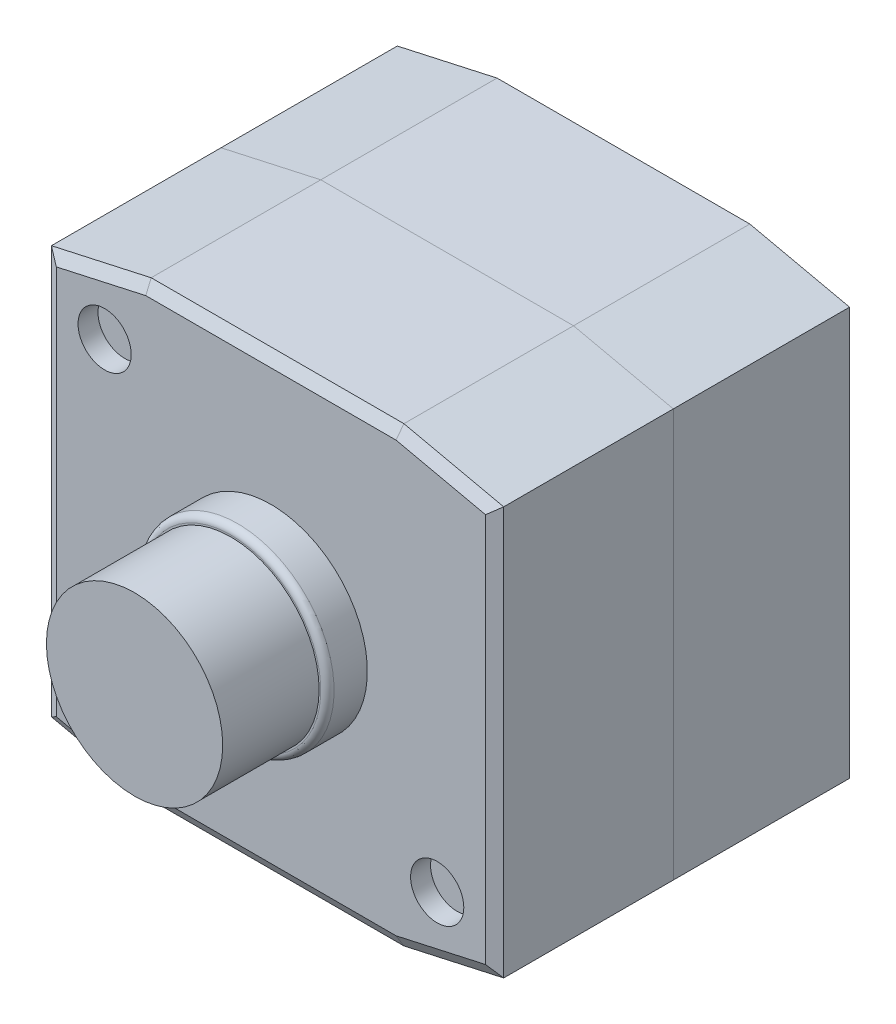
ISO-10303-21;
HEADER;
FILE_DESCRIPTION(('STEP AP214'),'2;1');
FILE_NAME('part.step','',(''),(''),'','','');
FILE_SCHEMA(('AUTOMOTIVE_DESIGN { 1 0 10303 214 1 1 1 1 }'));
ENDSEC;
DATA;
#1=APPLICATION_CONTEXT('core data for automotive mechanical design processes');
#2=APPLICATION_PROTOCOL_DEFINITION('international standard','automotive_design',2000,#1);
#3=PRODUCT_CONTEXT('',#1,'mechanical');
#4=PRODUCT('Part','Part','',(#3));
#5=PRODUCT_RELATED_PRODUCT_CATEGORY('part','',(#4));
#6=PRODUCT_DEFINITION_FORMATION('','',#4);
#7=PRODUCT_DEFINITION_CONTEXT('part definition',#1,'design');
#8=PRODUCT_DEFINITION('design','',#6,#7);
#9=PRODUCT_DEFINITION_SHAPE('','',#8);
#10=(LENGTH_UNIT() NAMED_UNIT(*) SI_UNIT(.MILLI.,.METRE.));
#11=(NAMED_UNIT(*) PLANE_ANGLE_UNIT() SI_UNIT($,.RADIAN.));
#12=(NAMED_UNIT(*) SI_UNIT($,.STERADIAN.) SOLID_ANGLE_UNIT());
#13=UNCERTAINTY_MEASURE_WITH_UNIT(LENGTH_MEASURE(1.E-05),#10,'distance_accuracy_value','');
#14=(GEOMETRIC_REPRESENTATION_CONTEXT(3) GLOBAL_UNCERTAINTY_ASSIGNED_CONTEXT((#13)) GLOBAL_UNIT_ASSIGNED_CONTEXT((#10,
#11,#12)) REPRESENTATION_CONTEXT('',''));
#15=CARTESIAN_POINT('',(0.,0.,0.));
#16=DIRECTION('',(0.,0.,1.));
#17=DIRECTION('',(1.,0.,0.));
#18=AXIS2_PLACEMENT_3D('',#15,#16,#17);
#19=CARTESIAN_POINT('',(-19.,0.,0.));
#20=DIRECTION('',(0.216439613938101,0.976296007119934,0.));
#21=DIRECTION('',(-0.976296007119934,0.216439613938101,0.));
#22=AXIS2_PLACEMENT_3D('',#19,#20,#21);
#23=PLANE('',#22);
#24=DIRECTION('',(-0.976296007119934,0.216439613938101,0.));
#25=VECTOR('',#24,1.);
#26=CARTESIAN_POINT('',(-19.,0.,26.5));
#27=LINE('',#26,#25);
#28=CARTESIAN_POINT('',(-19.,0.,26.5));
#29=VERTEX_POINT('',#28);
#30=CARTESIAN_POINT('',(-34.,3.32541993964407,26.5));
#31=VERTEX_POINT('',#30);
#32=EDGE_CURVE('E142',#29,#31,#27,.T.);
#33=ORIENTED_EDGE('',*,*,#32,.T.);
#34=DIRECTION('',(0.,0.,1.));
#35=VECTOR('',#34,1.);
#36=CARTESIAN_POINT('',(-34.,3.32541993964407,0.));
#37=LINE('',#36,#35);
#38=CARTESIAN_POINT('',(-34.,3.32541993964407,0.));
#39=VERTEX_POINT('',#38);
#40=EDGE_CURVE('E12',#39,#31,#37,.T.);
#41=ORIENTED_EDGE('',*,*,#40,.F.);
#42=DIRECTION('',(-0.976296007119934,0.216439613938101,0.));
#43=VECTOR('',#42,1.);
#44=CARTESIAN_POINT('',(-19.,0.,0.));
#45=LINE('',#44,#43);
#46=CARTESIAN_POINT('',(-19.,0.,0.));
#47=VERTEX_POINT('',#46);
#48=EDGE_CURVE('E156',#47,#39,#45,.T.);
#49=ORIENTED_EDGE('',*,*,#48,.F.);
#50=DIRECTION('',(0.,0.,1.));
#51=VECTOR('',#50,1.);
#52=CARTESIAN_POINT('',(-19.,0.,0.));
#53=LINE('',#52,#51);
#54=EDGE_CURVE('E138',#47,#29,#53,.T.);
#55=ORIENTED_EDGE('',*,*,#54,.T.);
#56=EDGE_LOOP('',(#33,#41,#49,#55));
#57=FACE_BOUND('',#56,.T.);
#58=ADVANCED_FACE('F46',(#57),#23,.F.);
#59=CARTESIAN_POINT('',(-34.,3.32541993964407,0.));
#60=DIRECTION('',(1.,0.,0.));
#61=DIRECTION('',(0.,1.,0.));
#62=AXIS2_PLACEMENT_3D('',#59,#60,#61);
#63=PLANE('',#62);
#64=DIRECTION('',(0.,1.,0.));
#65=VECTOR('',#64,1.);
#66=CARTESIAN_POINT('',(-34.,3.32541993964407,26.5));
#67=LINE('',#66,#65);
#68=CARTESIAN_POINT('',(-34.,64.674580060356,26.5));
#69=VERTEX_POINT('',#68);
#70=EDGE_CURVE('E145',#31,#69,#67,.T.);
#71=ORIENTED_EDGE('',*,*,#70,.T.);
#72=DIRECTION('',(0.,0.,1.));
#73=VECTOR('',#72,1.);
#74=CARTESIAN_POINT('',(-34.,64.674580060356,0.));
#75=LINE('',#74,#73);
#76=CARTESIAN_POINT('',(-34.,64.674580060356,0.));
#77=VERTEX_POINT('',#76);
#78=EDGE_CURVE('E54',#77,#69,#75,.T.);
#79=ORIENTED_EDGE('',*,*,#78,.F.);
#80=DIRECTION('',(0.,1.,0.));
#81=VECTOR('',#80,1.);
#82=CARTESIAN_POINT('',(-34.,3.32541993964407,0.));
#83=LINE('',#82,#81);
#84=EDGE_CURVE('E105',#39,#77,#83,.T.);
#85=ORIENTED_EDGE('',*,*,#84,.F.);
#86=ORIENTED_EDGE('',*,*,#40,.T.);
#87=EDGE_LOOP('',(#71,#79,#85,#86));
#88=FACE_BOUND('',#87,.T.);
#89=ADVANCED_FACE('F191',(#88),#63,.F.);
#90=CARTESIAN_POINT('',(-34.,64.674580060356,0.));
#91=DIRECTION('',(0.2164396139381,-0.976296007119934,0.));
#92=DIRECTION('',(0.976296007119934,0.2164396139381,0.));
#93=AXIS2_PLACEMENT_3D('',#90,#91,#92);
#94=PLANE('',#93);
#95=DIRECTION('',(0.976296007119934,0.2164396139381,0.));
#96=VECTOR('',#95,1.);
#97=CARTESIAN_POINT('',(-34.,64.674580060356,26.5));
#98=LINE('',#97,#96);
#99=CARTESIAN_POINT('',(-19.,68.,26.5));
#100=VERTEX_POINT('',#99);
#101=EDGE_CURVE('E147',#69,#100,#98,.T.);
#102=ORIENTED_EDGE('',*,*,#101,.T.);
#103=DIRECTION('',(0.,0.,1.));
#104=VECTOR('',#103,1.);
#105=CARTESIAN_POINT('',(-19.,68.,0.));
#106=LINE('',#105,#104);
#107=CARTESIAN_POINT('',(-19.,68.,0.));
#108=VERTEX_POINT('',#107);
#109=EDGE_CURVE('E163',#108,#100,#106,.T.);
#110=ORIENTED_EDGE('',*,*,#109,.F.);
#111=DIRECTION('',(0.976296007119934,0.2164396139381,0.));
#112=VECTOR('',#111,1.);
#113=CARTESIAN_POINT('',(-34.,64.674580060356,0.));
#114=LINE('',#113,#112);
#115=EDGE_CURVE('E171',#77,#108,#114,.T.);
#116=ORIENTED_EDGE('',*,*,#115,.F.);
#117=ORIENTED_EDGE('',*,*,#78,.T.);
#118=EDGE_LOOP('',(#102,#110,#116,#117));
#119=FACE_BOUND('',#118,.T.);
#120=ADVANCED_FACE('F169',(#119),#94,.F.);
#121=CARTESIAN_POINT('',(-19.,68.,0.));
#122=DIRECTION('',(0.,-1.,0.));
#123=DIRECTION('',(0.,0.,-1.));
#124=AXIS2_PLACEMENT_3D('',#121,#122,#123);
#125=PLANE('',#124);
#126=DIRECTION('',(1.,0.,0.));
#127=VECTOR('',#126,1.);
#128=CARTESIAN_POINT('',(-19.,68.,26.5));
#129=LINE('',#128,#127);
#130=CARTESIAN_POINT('',(19.,68.,26.5));
#131=VERTEX_POINT('',#130);
#132=EDGE_CURVE('E149',#100,#131,#129,.T.);
#133=ORIENTED_EDGE('',*,*,#132,.T.);
#134=DIRECTION('',(0.,0.,1.));
#135=VECTOR('',#134,1.);
#136=CARTESIAN_POINT('',(19.,68.,0.));
#137=LINE('',#136,#135);
#138=CARTESIAN_POINT('',(19.,68.,0.));
#139=VERTEX_POINT('',#138);
#140=EDGE_CURVE('E160',#139,#131,#137,.T.);
#141=ORIENTED_EDGE('',*,*,#140,.F.);
#142=DIRECTION('',(1.,0.,0.));
#143=VECTOR('',#142,1.);
#144=CARTESIAN_POINT('',(-19.,68.,0.));
#145=LINE('',#144,#143);
#146=EDGE_CURVE('E183',#108,#139,#145,.T.);
#147=ORIENTED_EDGE('',*,*,#146,.F.);
#148=ORIENTED_EDGE('',*,*,#109,.T.);
#149=EDGE_LOOP('',(#133,#141,#147,#148));
#150=FACE_BOUND('',#149,.T.);
#151=ADVANCED_FACE('F179',(#150),#125,.F.);
#152=CARTESIAN_POINT('',(19.,68.,0.));
#153=DIRECTION('',(-0.216439613938102,-0.976296007119934,0.));
#154=DIRECTION('',(0.976296007119934,-0.216439613938102,0.));
#155=AXIS2_PLACEMENT_3D('',#152,#153,#154);
#156=PLANE('',#155);
#157=DIRECTION('',(0.976296007119934,-0.216439613938102,0.));
#158=VECTOR('',#157,1.);
#159=CARTESIAN_POINT('',(19.,68.,26.5));
#160=LINE('',#159,#158);
#161=CARTESIAN_POINT('',(34.,64.6745800603559,26.5));
#162=VERTEX_POINT('',#161);
#163=EDGE_CURVE('E151',#131,#162,#160,.T.);
#164=ORIENTED_EDGE('',*,*,#163,.T.);
#165=DIRECTION('',(0.,0.,1.));
#166=VECTOR('',#165,1.);
#167=CARTESIAN_POINT('',(34.,64.6745800603559,0.));
#168=LINE('',#167,#166);
#169=CARTESIAN_POINT('',(34.,64.6745800603559,0.));
#170=VERTEX_POINT('',#169);
#171=EDGE_CURVE('E133',#170,#162,#168,.T.);
#172=ORIENTED_EDGE('',*,*,#171,.F.);
#173=DIRECTION('',(0.976296007119934,-0.216439613938102,0.));
#174=VECTOR('',#173,1.);
#175=CARTESIAN_POINT('',(19.,68.,0.));
#176=LINE('',#175,#174);
#177=EDGE_CURVE('E124',#139,#170,#176,.T.);
#178=ORIENTED_EDGE('',*,*,#177,.F.);
#179=ORIENTED_EDGE('',*,*,#140,.T.);
#180=EDGE_LOOP('',(#164,#172,#178,#179));
#181=FACE_BOUND('',#180,.T.);
#182=ADVANCED_FACE('F182',(#181),#156,.F.);
#183=CARTESIAN_POINT('',(34.,64.6745800603559,0.));
#184=DIRECTION('',(-1.,0.,0.));
#185=DIRECTION('',(0.,-1.,0.));
#186=AXIS2_PLACEMENT_3D('',#183,#184,#185);
#187=PLANE('',#186);
#188=DIRECTION('',(0.,-1.,0.));
#189=VECTOR('',#188,1.);
#190=CARTESIAN_POINT('',(34.,64.6745800603559,26.5));
#191=LINE('',#190,#189);
#192=CARTESIAN_POINT('',(34.,3.32541993964407,26.5));
#193=VERTEX_POINT('',#192);
#194=EDGE_CURVE('E132',#162,#193,#191,.T.);
#195=ORIENTED_EDGE('',*,*,#194,.T.);
#196=DIRECTION('',(0.,0.,1.));
#197=VECTOR('',#196,1.);
#198=CARTESIAN_POINT('',(34.,3.32541993964407,0.));
#199=LINE('',#198,#197);
#200=CARTESIAN_POINT('',(34.,3.32541993964407,0.));
#201=VERTEX_POINT('',#200);
#202=EDGE_CURVE('E129',#201,#193,#199,.T.);
#203=ORIENTED_EDGE('',*,*,#202,.F.);
#204=DIRECTION('',(0.,-1.,0.));
#205=VECTOR('',#204,1.);
#206=CARTESIAN_POINT('',(34.,64.6745800603559,0.));
#207=LINE('',#206,#205);
#208=EDGE_CURVE('E118',#170,#201,#207,.T.);
#209=ORIENTED_EDGE('',*,*,#208,.F.);
#210=ORIENTED_EDGE('',*,*,#171,.T.);
#211=EDGE_LOOP('',(#195,#203,#209,#210));
#212=FACE_BOUND('',#211,.T.);
#213=ADVANCED_FACE('F130',(#212),#187,.F.);
#214=CARTESIAN_POINT('',(34.,3.32541993964407,0.));
#215=DIRECTION('',(-0.216439613938101,0.976296007119934,0.));
#216=DIRECTION('',(-0.976296007119934,-0.216439613938101,0.));
#217=AXIS2_PLACEMENT_3D('',#214,#215,#216);
#218=PLANE('',#217);
#219=DIRECTION('',(-0.976296007119934,-0.216439613938101,0.));
#220=VECTOR('',#219,1.);
#221=CARTESIAN_POINT('',(34.,3.32541993964407,26.5));
#222=LINE('',#221,#220);
#223=CARTESIAN_POINT('',(19.,0.,26.5));
#224=VERTEX_POINT('',#223);
#225=EDGE_CURVE('E91',#193,#224,#222,.T.);
#226=ORIENTED_EDGE('',*,*,#225,.T.);
#227=DIRECTION('',(0.,0.,1.));
#228=VECTOR('',#227,1.);
#229=CARTESIAN_POINT('',(19.,0.,0.));
#230=LINE('',#229,#228);
#231=CARTESIAN_POINT('',(19.,0.,0.));
#232=VERTEX_POINT('',#231);
#233=EDGE_CURVE('E134',#232,#224,#230,.T.);
#234=ORIENTED_EDGE('',*,*,#233,.F.);
#235=DIRECTION('',(-0.976296007119934,-0.216439613938101,0.));
#236=VECTOR('',#235,1.);
#237=CARTESIAN_POINT('',(34.,3.32541993964407,0.));
#238=LINE('',#237,#236);
#239=EDGE_CURVE('E122',#201,#232,#238,.T.);
#240=ORIENTED_EDGE('',*,*,#239,.F.);
#241=ORIENTED_EDGE('',*,*,#202,.T.);
#242=EDGE_LOOP('',(#226,#234,#240,#241));
#243=FACE_BOUND('',#242,.T.);
#244=ADVANCED_FACE('F136',(#243),#218,.F.);
#245=CARTESIAN_POINT('',(19.,0.,0.));
#246=DIRECTION('',(0.,1.,0.));
#247=DIRECTION('',(0.,0.,1.));
#248=AXIS2_PLACEMENT_3D('',#245,#246,#247);
#249=PLANE('',#248);
#250=DIRECTION('',(-1.,0.,0.));
#251=VECTOR('',#250,1.);
#252=CARTESIAN_POINT('',(19.,0.,26.5));
#253=LINE('',#252,#251);
#254=EDGE_CURVE('E97',#224,#29,#253,.T.);
#255=ORIENTED_EDGE('',*,*,#254,.T.);
#256=ORIENTED_EDGE('',*,*,#54,.F.);
#257=DIRECTION('',(-1.,0.,0.));
#258=VECTOR('',#257,1.);
#259=CARTESIAN_POINT('',(19.,0.,0.));
#260=LINE('',#259,#258);
#261=EDGE_CURVE('E62',#232,#47,#260,.T.);
#262=ORIENTED_EDGE('',*,*,#261,.F.);
#263=ORIENTED_EDGE('',*,*,#233,.T.);
#264=EDGE_LOOP('',(#255,#256,#262,#263));
#265=FACE_BOUND('',#264,.T.);
#266=ADVANCED_FACE('F207',(#265),#249,.F.);
#267=CARTESIAN_POINT('',(0.,0.,0.));
#268=DIRECTION('',(0.,0.,-1.));
#269=DIRECTION('',(-1.,0.,0.));
#270=AXIS2_PLACEMENT_3D('',#267,#268,#269);
#271=PLANE('',#270);
#272=ORIENTED_EDGE('',*,*,#48,.T.);
#273=ORIENTED_EDGE('',*,*,#84,.T.);
#274=ORIENTED_EDGE('',*,*,#115,.T.);
#275=ORIENTED_EDGE('',*,*,#146,.T.);
#276=ORIENTED_EDGE('',*,*,#177,.T.);
#277=ORIENTED_EDGE('',*,*,#208,.T.);
#278=ORIENTED_EDGE('',*,*,#239,.T.);
#279=ORIENTED_EDGE('',*,*,#261,.T.);
#280=EDGE_LOOP('',(#272,#273,#274,#275,#276,#277,#278,#279));
#281=FACE_BOUND('',#280,.T.);
#282=ADVANCED_FACE('F120',(#281),#271,.T.);
#283=CARTESIAN_POINT('',(0.,0.,26.5));
#284=DIRECTION('',(0.,0.,-1.));
#285=DIRECTION('',(-1.,0.,0.));
#286=AXIS2_PLACEMENT_3D('',#283,#284,#285);
#287=PLANE('',#286);
#288=ORIENTED_EDGE('',*,*,#32,.F.);
#289=ORIENTED_EDGE('',*,*,#254,.F.);
#290=ORIENTED_EDGE('',*,*,#225,.F.);
#291=ORIENTED_EDGE('',*,*,#194,.F.);
#292=ORIENTED_EDGE('',*,*,#163,.F.);
#293=ORIENTED_EDGE('',*,*,#132,.F.);
#294=ORIENTED_EDGE('',*,*,#101,.F.);
#295=ORIENTED_EDGE('',*,*,#70,.F.);
#296=EDGE_LOOP('',(#288,#289,#290,#291,#292,#293,#294,#295));
#297=FACE_BOUND('',#296,.T.);
#298=ADVANCED_FACE('F175',(#297),#287,.F.);
#299=CLOSED_SHELL('',(#58,#89,#120,#151,#182,#213,#244,#266,#282,#298));
#300=MANIFOLD_SOLID_BREP('B2',#299);
#301=CARTESIAN_POINT('',(0.,34.,53.));
#302=DIRECTION('',(0.,0.,1.));
#303=DIRECTION('',(1.,0.,0.));
#304=AXIS2_PLACEMENT_3D('',#301,#302,#303);
#305=CYLINDRICAL_SURFACE('',#304,14.5);
#306=CARTESIAN_POINT('',(0.,34.,58.));
#307=DIRECTION('',(0.,0.,-1.));
#308=DIRECTION('',(-1.,0.,0.));
#309=AXIS2_PLACEMENT_3D('',#306,#307,#308);
#310=CIRCLE('',#309,14.5);
#311=CARTESIAN_POINT('',(-14.5,34.,58.));
#312=VERTEX_POINT('',#311);
#313=EDGE_CURVE('E281',#312,#312,#310,.T.);
#314=ORIENTED_EDGE('',*,*,#313,.T.);
#315=EDGE_LOOP('',(#314));
#316=FACE_BOUND('',#315,.T.);
#317=CARTESIAN_POINT('',(0.,34.,53.));
#318=DIRECTION('',(0.,0.,1.));
#319=DIRECTION('',(-1.,0.,0.));
#320=AXIS2_PLACEMENT_3D('',#317,#318,#319);
#321=CIRCLE('',#320,14.5);
#322=CARTESIAN_POINT('',(-14.5,34.,53.));
#323=VERTEX_POINT('',#322);
#324=EDGE_CURVE('E414',#323,#323,#321,.T.);
#325=ORIENTED_EDGE('',*,*,#324,.T.);
#326=EDGE_LOOP('',(#325));
#327=FACE_BOUND('',#326,.T.);
#328=ADVANCED_FACE('F273',(#316,#327),#305,.T.);
#329=CARTESIAN_POINT('',(0.,34.,59.));
#330=DIRECTION('',(0.,0.,-1.));
#331=DIRECTION('',(-1.,0.,0.));
#332=AXIS2_PLACEMENT_3D('',#329,#330,#331);
#333=PLANE('',#332);
#334=CARTESIAN_POINT('',(0.,34.,59.));
#335=DIRECTION('',(0.,0.,-1.));
#336=DIRECTION('',(-1.,0.,0.));
#337=AXIS2_PLACEMENT_3D('',#334,#335,#336);
#338=CIRCLE('',#337,13.25);
#339=CARTESIAN_POINT('',(-13.25,34.,59.));
#340=VERTEX_POINT('',#339);
#341=EDGE_CURVE('E44',#340,#340,#338,.F.);
#342=ORIENTED_EDGE('',*,*,#341,.F.);
#343=EDGE_LOOP('',(#342));
#344=FACE_BOUND('',#343,.T.);
#345=CARTESIAN_POINT('',(0.,34.,59.));
#346=DIRECTION('',(0.,0.,-1.));
#347=DIRECTION('',(-1.,0.,0.));
#348=AXIS2_PLACEMENT_3D('',#345,#346,#347);
#349=CIRCLE('',#348,13.5);
#350=CARTESIAN_POINT('',(-13.5,34.,59.));
#351=VERTEX_POINT('',#350);
#352=EDGE_CURVE('E487',#351,#351,#349,.F.);
#353=ORIENTED_EDGE('',*,*,#352,.T.);
#354=EDGE_LOOP('',(#353));
#355=FACE_BOUND('',#354,.T.);
#356=ADVANCED_FACE('F500',(#344,#355),#333,.F.);
#357=CARTESIAN_POINT('',(-34.,3.32541993964407,26.5));
#358=DIRECTION('',(-0.216439613938101,-0.976296007119934,0.));
#359=DIRECTION('',(0.976296007119934,-0.216439613938101,0.));
#360=AXIS2_PLACEMENT_3D('',#357,#358,#359);
#361=PLANE('',#360);
#362=DIRECTION('',(0.,0.,1.));
#363=VECTOR('',#362,1.);
#364=CARTESIAN_POINT('',(-19.,0.,26.5));
#365=LINE('',#364,#363);
#366=CARTESIAN_POINT('',(-19.,0.,26.5));
#367=VERTEX_POINT('',#366);
#368=CARTESIAN_POINT('',(-19.,0.,52.));
#369=VERTEX_POINT('',#368);
#370=EDGE_CURVE('E365',#367,#369,#365,.T.);
#371=ORIENTED_EDGE('',*,*,#370,.T.);
#372=DIRECTION('',(-0.976296007119934,0.216439613938101,0.));
#373=VECTOR('',#372,1.);
#374=CARTESIAN_POINT('',(-34.,3.32541993964407,52.));
#375=LINE('',#374,#373);
#376=CARTESIAN_POINT('',(-34.,3.32541993964407,52.));
#377=VERTEX_POINT('',#376);
#378=EDGE_CURVE('E456',#369,#377,#375,.T.);
#379=ORIENTED_EDGE('',*,*,#378,.T.);
#380=DIRECTION('',(0.,0.,1.));
#381=VECTOR('',#380,1.);
#382=CARTESIAN_POINT('',(-34.,3.32541993964407,26.5));
#383=LINE('',#382,#381);
#384=CARTESIAN_POINT('',(-34.,3.32541993964407,26.5));
#385=VERTEX_POINT('',#384);
#386=EDGE_CURVE('E391',#385,#377,#383,.T.);
#387=ORIENTED_EDGE('',*,*,#386,.F.);
#388=DIRECTION('',(0.976296007119934,-0.216439613938101,0.));
#389=VECTOR('',#388,1.);
#390=CARTESIAN_POINT('',(-34.,3.32541993964407,26.5));
#391=LINE('',#390,#389);
#392=EDGE_CURVE('E383',#385,#367,#391,.T.);
#393=ORIENTED_EDGE('',*,*,#392,.T.);
#394=EDGE_LOOP('',(#371,#379,#387,#393));
#395=FACE_BOUND('',#394,.T.);
#396=ADVANCED_FACE('F389',(#395),#361,.T.);
#397=CARTESIAN_POINT('',(-34.,64.674580060356,26.5));
#398=DIRECTION('',(-1.,0.,0.));
#399=DIRECTION('',(0.,-1.,0.));
#400=AXIS2_PLACEMENT_3D('',#397,#398,#399);
#401=PLANE('',#400);
#402=ORIENTED_EDGE('',*,*,#386,.T.);
#403=DIRECTION('',(0.,1.,0.));
#404=VECTOR('',#403,1.);
#405=CARTESIAN_POINT('',(-34.,64.674580060356,52.));
#406=LINE('',#405,#404);
#407=CARTESIAN_POINT('',(-34.,64.674580060356,52.));
#408=VERTEX_POINT('',#407);
#409=EDGE_CURVE('E454',#377,#408,#406,.T.);
#410=ORIENTED_EDGE('',*,*,#409,.T.);
#411=DIRECTION('',(0.,0.,1.));
#412=VECTOR('',#411,1.);
#413=CARTESIAN_POINT('',(-34.,64.674580060356,26.5));
#414=LINE('',#413,#412);
#415=CARTESIAN_POINT('',(-34.,64.674580060356,26.5));
#416=VERTEX_POINT('',#415);
#417=EDGE_CURVE('E415',#416,#408,#414,.T.);
#418=ORIENTED_EDGE('',*,*,#417,.F.);
#419=DIRECTION('',(0.,-1.,0.));
#420=VECTOR('',#419,1.);
#421=CARTESIAN_POINT('',(-34.,64.674580060356,26.5));
#422=LINE('',#421,#420);
#423=EDGE_CURVE('E376',#416,#385,#422,.T.);
#424=ORIENTED_EDGE('',*,*,#423,.T.);
#425=EDGE_LOOP('',(#402,#410,#418,#424));
#426=FACE_BOUND('',#425,.T.);
#427=ADVANCED_FACE('F508',(#426),#401,.T.);
#428=CARTESIAN_POINT('',(-19.,68.,26.5));
#429=DIRECTION('',(-0.2164396139381,0.976296007119934,0.));
#430=DIRECTION('',(-0.976296007119934,-0.2164396139381,0.));
#431=AXIS2_PLACEMENT_3D('',#428,#429,#430);
#432=PLANE('',#431);
#433=ORIENTED_EDGE('',*,*,#417,.T.);
#434=DIRECTION('',(0.976296007119934,0.2164396139381,0.));
#435=VECTOR('',#434,1.);
#436=CARTESIAN_POINT('',(-19.,68.,52.));
#437=LINE('',#436,#435);
#438=CARTESIAN_POINT('',(-19.,68.,52.));
#439=VERTEX_POINT('',#438);
#440=EDGE_CURVE('E452',#408,#439,#437,.T.);
#441=ORIENTED_EDGE('',*,*,#440,.T.);
#442=DIRECTION('',(0.,0.,1.));
#443=VECTOR('',#442,1.);
#444=CARTESIAN_POINT('',(-19.,68.,26.5));
#445=LINE('',#444,#443);
#446=CARTESIAN_POINT('',(-19.,68.,26.5));
#447=VERTEX_POINT('',#446);
#448=EDGE_CURVE('E418',#447,#439,#445,.T.);
#449=ORIENTED_EDGE('',*,*,#448,.F.);
#450=DIRECTION('',(-0.976296007119934,-0.2164396139381,0.));
#451=VECTOR('',#450,1.);
#452=CARTESIAN_POINT('',(-19.,68.,26.5));
#453=LINE('',#452,#451);
#454=EDGE_CURVE('E409',#447,#416,#453,.T.);
#455=ORIENTED_EDGE('',*,*,#454,.T.);
#456=EDGE_LOOP('',(#433,#441,#449,#455));
#457=FACE_BOUND('',#456,.T.);
#458=ADVANCED_FACE('F598',(#457),#432,.T.);
#459=CARTESIAN_POINT('',(19.,68.,26.5));
#460=DIRECTION('',(0.,1.,0.));
#461=DIRECTION('',(0.,0.,1.));
#462=AXIS2_PLACEMENT_3D('',#459,#460,#461);
#463=PLANE('',#462);
#464=ORIENTED_EDGE('',*,*,#448,.T.);
#465=DIRECTION('',(1.,0.,0.));
#466=VECTOR('',#465,1.);
#467=CARTESIAN_POINT('',(19.,68.,52.));
#468=LINE('',#467,#466);
#469=CARTESIAN_POINT('',(19.,68.,52.));
#470=VERTEX_POINT('',#469);
#471=EDGE_CURVE('E450',#439,#470,#468,.T.);
#472=ORIENTED_EDGE('',*,*,#471,.T.);
#473=DIRECTION('',(0.,0.,1.));
#474=VECTOR('',#473,1.);
#475=CARTESIAN_POINT('',(19.,68.,26.5));
#476=LINE('',#475,#474);
#477=CARTESIAN_POINT('',(19.,68.,26.5));
#478=VERTEX_POINT('',#477);
#479=EDGE_CURVE('E421',#478,#470,#476,.T.);
#480=ORIENTED_EDGE('',*,*,#479,.F.);
#481=DIRECTION('',(-1.,0.,0.));
#482=VECTOR('',#481,1.);
#483=CARTESIAN_POINT('',(19.,68.,26.5));
#484=LINE('',#483,#482);
#485=EDGE_CURVE('E406',#478,#447,#484,.T.);
#486=ORIENTED_EDGE('',*,*,#485,.T.);
#487=EDGE_LOOP('',(#464,#472,#480,#486));
#488=FACE_BOUND('',#487,.T.);
#489=ADVANCED_FACE('F596',(#488),#463,.T.);
#490=CARTESIAN_POINT('',(34.,64.6745800603559,26.5));
#491=DIRECTION('',(0.216439613938102,0.976296007119934,0.));
#492=DIRECTION('',(-0.976296007119934,0.216439613938102,0.));
#493=AXIS2_PLACEMENT_3D('',#490,#491,#492);
#494=PLANE('',#493);
#495=ORIENTED_EDGE('',*,*,#479,.T.);
#496=DIRECTION('',(0.976296007119934,-0.216439613938102,0.));
#497=VECTOR('',#496,1.);
#498=CARTESIAN_POINT('',(34.,64.6745800603559,52.));
#499=LINE('',#498,#497);
#500=CARTESIAN_POINT('',(34.,64.6745800603559,52.));
#501=VERTEX_POINT('',#500);
#502=EDGE_CURVE('E447',#470,#501,#499,.T.);
#503=ORIENTED_EDGE('',*,*,#502,.T.);
#504=DIRECTION('',(0.,0.,1.));
#505=VECTOR('',#504,1.);
#506=CARTESIAN_POINT('',(34.,64.6745800603559,26.5));
#507=LINE('',#506,#505);
#508=CARTESIAN_POINT('',(34.,64.6745800603559,26.5));
#509=VERTEX_POINT('',#508);
#510=EDGE_CURVE('E424',#509,#501,#507,.T.);
#511=ORIENTED_EDGE('',*,*,#510,.F.);
#512=DIRECTION('',(-0.976296007119934,0.216439613938102,0.));
#513=VECTOR('',#512,1.);
#514=CARTESIAN_POINT('',(34.,64.6745800603559,26.5));
#515=LINE('',#514,#513);
#516=EDGE_CURVE('E403',#509,#478,#515,.T.);
#517=ORIENTED_EDGE('',*,*,#516,.T.);
#518=EDGE_LOOP('',(#495,#503,#511,#517));
#519=FACE_BOUND('',#518,.T.);
#520=ADVANCED_FACE('F594',(#519),#494,.T.);
#521=CARTESIAN_POINT('',(34.,3.32541993964407,26.5));
#522=DIRECTION('',(1.,0.,0.));
#523=DIRECTION('',(0.,1.,0.));
#524=AXIS2_PLACEMENT_3D('',#521,#522,#523);
#525=PLANE('',#524);
#526=ORIENTED_EDGE('',*,*,#510,.T.);
#527=DIRECTION('',(0.,-1.,0.));
#528=VECTOR('',#527,1.);
#529=CARTESIAN_POINT('',(34.,3.32541993964407,52.));
#530=LINE('',#529,#528);
#531=CARTESIAN_POINT('',(34.,3.32541993964407,52.));
#532=VERTEX_POINT('',#531);
#533=EDGE_CURVE('E484',#501,#532,#530,.T.);
#534=ORIENTED_EDGE('',*,*,#533,.T.);
#535=DIRECTION('',(0.,0.,1.));
#536=VECTOR('',#535,1.);
#537=CARTESIAN_POINT('',(34.,3.32541993964407,26.5));
#538=LINE('',#537,#536);
#539=CARTESIAN_POINT('',(34.,3.32541993964407,26.5));
#540=VERTEX_POINT('',#539);
#541=EDGE_CURVE('E427',#540,#532,#538,.T.);
#542=ORIENTED_EDGE('',*,*,#541,.F.);
#543=DIRECTION('',(0.,1.,0.));
#544=VECTOR('',#543,1.);
#545=CARTESIAN_POINT('',(34.,3.32541993964407,26.5));
#546=LINE('',#545,#544);
#547=EDGE_CURVE('E400',#540,#509,#546,.T.);
#548=ORIENTED_EDGE('',*,*,#547,.T.);
#549=EDGE_LOOP('',(#526,#534,#542,#548));
#550=FACE_BOUND('',#549,.T.);
#551=ADVANCED_FACE('F589',(#550),#525,.T.);
#552=CARTESIAN_POINT('',(19.,0.,26.5));
#553=DIRECTION('',(0.216439613938101,-0.976296007119934,0.));
#554=DIRECTION('',(0.976296007119934,0.216439613938101,0.));
#555=AXIS2_PLACEMENT_3D('',#552,#553,#554);
#556=PLANE('',#555);
#557=ORIENTED_EDGE('',*,*,#541,.T.);
#558=DIRECTION('',(-0.976296007119934,-0.216439613938101,0.));
#559=VECTOR('',#558,1.);
#560=CARTESIAN_POINT('',(19.,0.,52.));
#561=LINE('',#560,#559);
#562=CARTESIAN_POINT('',(19.,0.,52.));
#563=VERTEX_POINT('',#562);
#564=EDGE_CURVE('E459',#532,#563,#561,.T.);
#565=ORIENTED_EDGE('',*,*,#564,.T.);
#566=DIRECTION('',(0.,0.,1.));
#567=VECTOR('',#566,1.);
#568=CARTESIAN_POINT('',(19.,0.,26.5));
#569=LINE('',#568,#567);
#570=CARTESIAN_POINT('',(19.,0.,26.5));
#571=VERTEX_POINT('',#570);
#572=EDGE_CURVE('E375',#571,#563,#569,.T.);
#573=ORIENTED_EDGE('',*,*,#572,.F.);
#574=DIRECTION('',(0.976296007119934,0.216439613938101,0.));
#575=VECTOR('',#574,1.);
#576=CARTESIAN_POINT('',(19.,0.,26.5));
#577=LINE('',#576,#575);
#578=EDGE_CURVE('E387',#571,#540,#577,.T.);
#579=ORIENTED_EDGE('',*,*,#578,.T.);
#580=EDGE_LOOP('',(#557,#565,#573,#579));
#581=FACE_BOUND('',#580,.T.);
#582=ADVANCED_FACE('F587',(#581),#556,.T.);
#583=CARTESIAN_POINT('',(-19.,0.,26.5));
#584=DIRECTION('',(0.,-1.,0.));
#585=DIRECTION('',(0.,0.,-1.));
#586=AXIS2_PLACEMENT_3D('',#583,#584,#585);
#587=PLANE('',#586);
#588=ORIENTED_EDGE('',*,*,#572,.T.);
#589=DIRECTION('',(-1.,0.,0.));
#590=VECTOR('',#589,1.);
#591=CARTESIAN_POINT('',(-19.,0.,52.));
#592=LINE('',#591,#590);
#593=EDGE_CURVE('E371',#563,#369,#592,.T.);
#594=ORIENTED_EDGE('',*,*,#593,.T.);
#595=ORIENTED_EDGE('',*,*,#370,.F.);
#596=DIRECTION('',(1.,0.,0.));
#597=VECTOR('',#596,1.);
#598=CARTESIAN_POINT('',(-19.,0.,26.5));
#599=LINE('',#598,#597);
#600=EDGE_CURVE('E369',#367,#571,#599,.T.);
#601=ORIENTED_EDGE('',*,*,#600,.T.);
#602=EDGE_LOOP('',(#588,#594,#595,#601));
#603=FACE_BOUND('',#602,.T.);
#604=ADVANCED_FACE('F368',(#603),#587,.T.);
#605=CARTESIAN_POINT('',(0.,0.,26.5));
#606=DIRECTION('',(0.,0.,1.));
#607=DIRECTION('',(1.,0.,0.));
#608=AXIS2_PLACEMENT_3D('',#605,#606,#607);
#609=PLANE('',#608);
#610=ORIENTED_EDGE('',*,*,#392,.F.);
#611=ORIENTED_EDGE('',*,*,#423,.F.);
#612=ORIENTED_EDGE('',*,*,#454,.F.);
#613=ORIENTED_EDGE('',*,*,#485,.F.);
#614=ORIENTED_EDGE('',*,*,#516,.F.);
#615=ORIENTED_EDGE('',*,*,#547,.F.);
#616=ORIENTED_EDGE('',*,*,#578,.F.);
#617=ORIENTED_EDGE('',*,*,#600,.F.);
#618=EDGE_LOOP('',(#610,#611,#612,#613,#614,#615,#616,#617));
#619=FACE_BOUND('',#618,.T.);
#620=ADVANCED_FACE('F381',(#619),#609,.F.);
#621=CARTESIAN_POINT('',(0.,0.,53.));
#622=DIRECTION('',(0.,0.,1.));
#623=DIRECTION('',(1.,0.,0.));
#624=AXIS2_PLACEMENT_3D('',#621,#622,#623);
#625=PLANE('',#624);
#626=CARTESIAN_POINT('',(-25.,57.5,53.));
#627=DIRECTION('',(0.,0.,1.));
#628=DIRECTION('',(1.,0.,0.));
#629=AXIS2_PLACEMENT_3D('',#626,#627,#628);
#630=CIRCLE('',#629,3.99999999999999);
#631=CARTESIAN_POINT('',(-21.,57.5,53.));
#632=VERTEX_POINT('',#631);
#633=EDGE_CURVE('E481',#632,#632,#630,.T.);
#634=ORIENTED_EDGE('',*,*,#633,.F.);
#635=EDGE_LOOP('',(#634));
#636=FACE_BOUND('',#635,.T.);
#637=CARTESIAN_POINT('',(25.,10.5,53.));
#638=DIRECTION('',(0.,0.,1.));
#639=DIRECTION('',(1.,0.,0.));
#640=AXIS2_PLACEMENT_3D('',#637,#638,#639);
#641=CIRCLE('',#640,3.99999999999999);
#642=CARTESIAN_POINT('',(29.,10.5,53.));
#643=VERTEX_POINT('',#642);
#644=EDGE_CURVE('E395',#643,#643,#641,.T.);
#645=ORIENTED_EDGE('',*,*,#644,.F.);
#646=EDGE_LOOP('',(#645));
#647=FACE_BOUND('',#646,.T.);
#648=ORIENTED_EDGE('',*,*,#324,.F.);
#649=EDGE_LOOP('',(#648));
#650=FACE_BOUND('',#649,.T.);
#651=DIRECTION('',(0.976296007119934,0.216439613938101,0.));
#652=VECTOR('',#651,1.);
#653=CARTESIAN_POINT('',(0.515191615040425,-2.32387919897825,53.));
#654=LINE('',#653,#652);
#655=CARTESIAN_POINT('',(18.8103095858309,1.73205080756889,53.));
#656=VERTEX_POINT('',#655);
#657=CARTESIAN_POINT('',(32.2679491924311,4.71553768012438,53.));
#658=VERTEX_POINT('',#657);
#659=EDGE_CURVE('E433',#656,#658,#654,.T.);
#660=ORIENTED_EDGE('',*,*,#659,.T.);
#661=DIRECTION('',(0.,1.,0.));
#662=VECTOR('',#661,1.);
#663=CARTESIAN_POINT('',(32.2679491924311,0.,53.));
#664=LINE('',#663,#662);
#665=CARTESIAN_POINT('',(32.2679491924311,63.2844623198756,53.));
#666=VERTEX_POINT('',#665);
#667=EDGE_CURVE('E461',#658,#666,#664,.T.);
#668=ORIENTED_EDGE('',*,*,#667,.T.);
#669=DIRECTION('',(-0.976296007119934,0.216439613938102,0.));
#670=VECTOR('',#669,1.);
#671=CARTESIAN_POINT('',(14.8842125142241,67.1383439582244,53.));
#672=LINE('',#671,#670);
#673=CARTESIAN_POINT('',(18.8103095858308,66.2679491924311,53.));
#674=VERTEX_POINT('',#673);
#675=EDGE_CURVE('E445',#666,#674,#672,.T.);
#676=ORIENTED_EDGE('',*,*,#675,.T.);
#677=DIRECTION('',(-1.,0.,0.));
#678=VECTOR('',#677,1.);
#679=CARTESIAN_POINT('',(0.,66.2679491924311,53.));
#680=LINE('',#679,#678);
#681=CARTESIAN_POINT('',(-18.8103095858308,66.2679491924311,53.));
#682=VERTEX_POINT('',#681);
#683=EDGE_CURVE('E443',#674,#682,#680,.T.);
#684=ORIENTED_EDGE('',*,*,#683,.T.);
#685=DIRECTION('',(-0.976296007119934,-0.2164396139381,0.));
#686=VECTOR('',#685,1.);
#687=CARTESIAN_POINT('',(-14.884212514224,67.1383439582244,53.));
#688=LINE('',#687,#686);
#689=CARTESIAN_POINT('',(-32.2679491924311,63.2844623198756,53.));
#690=VERTEX_POINT('',#689);
#691=EDGE_CURVE('E441',#682,#690,#688,.T.);
#692=ORIENTED_EDGE('',*,*,#691,.T.);
#693=DIRECTION('',(0.,-1.,0.));
#694=VECTOR('',#693,1.);
#695=CARTESIAN_POINT('',(-32.2679491924311,0.,53.));
#696=LINE('',#695,#694);
#697=CARTESIAN_POINT('',(-32.2679491924311,4.71553768012437,53.));
#698=VERTEX_POINT('',#697);
#699=EDGE_CURVE('E439',#690,#698,#696,.T.);
#700=ORIENTED_EDGE('',*,*,#699,.T.);
#701=DIRECTION('',(0.976296007119934,-0.216439613938101,0.));
#702=VECTOR('',#701,1.);
#703=CARTESIAN_POINT('',(-0.515191615040424,-2.32387919897825,53.));
#704=LINE('',#703,#702);
#705=CARTESIAN_POINT('',(-18.8103095858309,1.73205080756889,53.));
#706=VERTEX_POINT('',#705);
#707=EDGE_CURVE('E437',#698,#706,#704,.T.);
#708=ORIENTED_EDGE('',*,*,#707,.T.);
#709=DIRECTION('',(1.,0.,0.));
#710=VECTOR('',#709,1.);
#711=CARTESIAN_POINT('',(0.,1.73205080756889,53.));
#712=LINE('',#711,#710);
#713=EDGE_CURVE('E435',#706,#656,#712,.T.);
#714=ORIENTED_EDGE('',*,*,#713,.T.);
#715=EDGE_LOOP('',(#660,#668,#676,#684,#692,#700,#708,#714));
#716=FACE_BOUND('',#715,.T.);
#717=ADVANCED_FACE('F570',(#636,#647,#650,#716),#625,.T.);
#718=CARTESIAN_POINT('',(25.,10.5,50.));
#719=DIRECTION('',(0.,0.,-1.));
#720=DIRECTION('',(-1.,0.,0.));
#721=AXIS2_PLACEMENT_3D('',#718,#719,#720);
#722=PLANE('',#721);
#723=CARTESIAN_POINT('',(25.,10.5,50.));
#724=DIRECTION('',(0.,0.,1.));
#725=DIRECTION('',(1.,0.,0.));
#726=AXIS2_PLACEMENT_3D('',#723,#724,#725);
#727=CIRCLE('',#726,3.99999999999999);
#728=CARTESIAN_POINT('',(29.,10.5,50.));
#729=VERTEX_POINT('',#728);
#730=EDGE_CURVE('E392',#729,#729,#727,.T.);
#731=ORIENTED_EDGE('',*,*,#730,.T.);
#732=EDGE_LOOP('',(#731));
#733=FACE_BOUND('',#732,.T.);
#734=ADVANCED_FACE('F623',(#733),#722,.F.);
#735=CARTESIAN_POINT('',(25.,10.5,53.));
#736=DIRECTION('',(0.,0.,1.));
#737=DIRECTION('',(1.,0.,0.));
#738=AXIS2_PLACEMENT_3D('',#735,#736,#737);
#739=CYLINDRICAL_SURFACE('',#738,3.99999999999999);
#740=ORIENTED_EDGE('',*,*,#730,.F.);
#741=EDGE_LOOP('',(#740));
#742=FACE_BOUND('',#741,.T.);
#743=ORIENTED_EDGE('',*,*,#644,.T.);
#744=EDGE_LOOP('',(#743));
#745=FACE_BOUND('',#744,.T.);
#746=ADVANCED_FACE('F628',(#742,#745),#739,.F.);
#747=CARTESIAN_POINT('',(-25.,57.5,50.));
#748=DIRECTION('',(0.,0.,-1.));
#749=DIRECTION('',(-1.,0.,0.));
#750=AXIS2_PLACEMENT_3D('',#747,#748,#749);
#751=PLANE('',#750);
#752=CARTESIAN_POINT('',(-25.,57.5,50.));
#753=DIRECTION('',(0.,0.,1.));
#754=DIRECTION('',(1.,0.,0.));
#755=AXIS2_PLACEMENT_3D('',#752,#753,#754);
#756=CIRCLE('',#755,3.99999999999999);
#757=CARTESIAN_POINT('',(-21.,57.5,50.));
#758=VERTEX_POINT('',#757);
#759=EDGE_CURVE('E654',#758,#758,#756,.T.);
#760=ORIENTED_EDGE('',*,*,#759,.T.);
#761=EDGE_LOOP('',(#760));
#762=FACE_BOUND('',#761,.T.);
#763=ADVANCED_FACE('F632',(#762),#751,.F.);
#764=CARTESIAN_POINT('',(-25.,57.5,53.));
#765=DIRECTION('',(0.,0.,1.));
#766=DIRECTION('',(1.,0.,0.));
#767=AXIS2_PLACEMENT_3D('',#764,#765,#766);
#768=CYLINDRICAL_SURFACE('',#767,3.99999999999999);
#769=ORIENTED_EDGE('',*,*,#759,.F.);
#770=EDGE_LOOP('',(#769));
#771=FACE_BOUND('',#770,.T.);
#772=ORIENTED_EDGE('',*,*,#633,.T.);
#773=EDGE_LOOP('',(#772));
#774=FACE_BOUND('',#773,.T.);
#775=ADVANCED_FACE('F562',(#771,#774),#768,.F.);
#776=CARTESIAN_POINT('',(0.515191615040425,-2.32387919897825,53.));
#777=DIRECTION('',(-0.10821980696905,0.488148003559964,-0.86602540378444));
#778=DIRECTION('',(0.976296007119934,0.216439613938101,0.));
#779=AXIS2_PLACEMENT_3D('',#776,#777,#778);
#780=PLANE('',#779);
#781=ORIENTED_EDGE('',*,*,#564,.F.);
#782=DIRECTION('',(-0.711122489842335,0.570736138030448,0.410566760937277));
#783=VECTOR('',#782,1.);
#784=CARTESIAN_POINT('',(19.0677732291786,15.3097989476303,60.6211251457344));
#785=LINE('',#784,#783);
#786=EDGE_CURVE('E288',#532,#658,#785,.T.);
#787=ORIENTED_EDGE('',*,*,#786,.T.);
#788=ORIENTED_EDGE('',*,*,#659,.F.);
#789=DIRECTION('',(0.0944214683896748,-0.862156273381083,-0.497766156520089));
#790=VECTOR('',#789,1.);
#791=CARTESIAN_POINT('',(18.9773783273599,0.206557018374013,52.1192557501612));
#792=LINE('',#791,#790);
#793=EDGE_CURVE('E478',#563,#656,#792,.F.);
#794=ORIENTED_EDGE('',*,*,#793,.F.);
#795=EDGE_LOOP('',(#781,#787,#788,#794));
#796=FACE_BOUND('',#795,.T.);
#797=ADVANCED_FACE('F557',(#796),#780,.F.);
#798=CARTESIAN_POINT('',(0.,1.73205080756889,53.));
#799=DIRECTION('',(0.,0.499999999999997,-0.86602540378444));
#800=DIRECTION('',(1.,0.,0.));
#801=AXIS2_PLACEMENT_3D('',#798,#799,#800);
#802=PLANE('',#801);
#803=ORIENTED_EDGE('',*,*,#793,.T.);
#804=ORIENTED_EDGE('',*,*,#713,.F.);
#805=DIRECTION('',(-0.0944214683896692,-0.862156273381083,-0.497766156520089));
#806=VECTOR('',#805,1.);
#807=CARTESIAN_POINT('',(-18.6426078941824,3.26332402304849,53.88408100316));
#808=LINE('',#807,#806);
#809=EDGE_CURVE('E475',#369,#706,#808,.F.);
#810=ORIENTED_EDGE('',*,*,#809,.F.);
#811=ORIENTED_EDGE('',*,*,#593,.F.);
#812=EDGE_LOOP('',(#803,#804,#810,#811));
#813=FACE_BOUND('',#812,.T.);
#814=ADVANCED_FACE('F550',(#813),#802,.F.);
#815=CARTESIAN_POINT('',(-0.515191615040424,-2.32387919897825,53.));
#816=DIRECTION('',(0.10821980696905,0.488148003559965,-0.86602540378444));
#817=DIRECTION('',(0.976296007119934,-0.216439613938101,0.));
#818=AXIS2_PLACEMENT_3D('',#815,#816,#817);
#819=PLANE('',#818);
#820=ORIENTED_EDGE('',*,*,#809,.T.);
#821=ORIENTED_EDGE('',*,*,#707,.F.);
#822=DIRECTION('',(-0.711122489842347,-0.570736138030437,-0.410566760937272));
#823=VECTOR('',#822,1.);
#824=CARTESIAN_POINT('',(-19.0677732291781,15.3097989476304,60.6211251457345));
#825=LINE('',#824,#823);
#826=EDGE_CURVE('E472',#377,#698,#825,.F.);
#827=ORIENTED_EDGE('',*,*,#826,.F.);
#828=ORIENTED_EDGE('',*,*,#378,.F.);
#829=EDGE_LOOP('',(#820,#821,#827,#828));
#830=FACE_BOUND('',#829,.T.);
#831=ADVANCED_FACE('F543',(#830),#819,.F.);
#832=CARTESIAN_POINT('',(-32.2679491924311,0.,53.));
#833=DIRECTION('',(0.499999999999997,0.,-0.86602540378444));
#834=DIRECTION('',(0.,-1.,0.));
#835=AXIS2_PLACEMENT_3D('',#832,#833,#834);
#836=PLANE('',#835);
#837=ORIENTED_EDGE('',*,*,#826,.T.);
#838=ORIENTED_EDGE('',*,*,#699,.F.);
#839=DIRECTION('',(-0.711122489842347,0.570736138030436,-0.410566760937273));
#840=VECTOR('',#839,1.);
#841=CARTESIAN_POINT('',(-6.58310825384944,42.6701980649763,67.8291498299827));
#842=LINE('',#841,#840);
#843=EDGE_CURVE('E469',#408,#690,#842,.F.);
#844=ORIENTED_EDGE('',*,*,#843,.F.);
#845=ORIENTED_EDGE('',*,*,#409,.F.);
#846=EDGE_LOOP('',(#837,#838,#844,#845));
#847=FACE_BOUND('',#846,.T.);
#848=ADVANCED_FACE('F536',(#847),#836,.F.);
#849=CARTESIAN_POINT('',(-14.884212514224,67.1383439582244,53.));
#850=DIRECTION('',(0.10821980696905,-0.488148003559965,-0.86602540378444));
#851=DIRECTION('',(-0.976296007119934,-0.2164396139381,0.));
#852=AXIS2_PLACEMENT_3D('',#849,#850,#851);
#853=PLANE('',#852);
#854=ORIENTED_EDGE('',*,*,#843,.T.);
#855=ORIENTED_EDGE('',*,*,#691,.F.);
#856=DIRECTION('',(-0.0944214683896761,0.862156273381082,-0.49776615652009));
#857=VECTOR('',#856,1.);
#858=CARTESIAN_POINT('',(-18.8461622159107,66.5953172207802,52.8109939807086));
#859=LINE('',#858,#857);
#860=EDGE_CURVE('E465',#439,#682,#859,.F.);
#861=ORIENTED_EDGE('',*,*,#860,.F.);
#862=ORIENTED_EDGE('',*,*,#440,.F.);
#863=EDGE_LOOP('',(#854,#855,#861,#862));
#864=FACE_BOUND('',#863,.T.);
#865=ADVANCED_FACE('F529',(#864),#853,.F.);
#866=CARTESIAN_POINT('',(0.,66.2679491924311,53.));
#867=DIRECTION('',(0.,-0.499999999999998,-0.866025403784439));
#868=DIRECTION('',(-1.,0.,0.));
#869=AXIS2_PLACEMENT_3D('',#866,#867,#868);
#870=PLANE('',#869);
#871=ORIENTED_EDGE('',*,*,#860,.T.);
#872=ORIENTED_EDGE('',*,*,#683,.F.);
#873=DIRECTION('',(0.0944214683896976,0.86215627338108,-0.497766156520089));
#874=VECTOR('',#873,1.);
#875=CARTESIAN_POINT('',(18.6426078941822,64.7366759769511,53.8840810031603));
#876=LINE('',#875,#874);
#877=EDGE_CURVE('E462',#470,#674,#876,.F.);
#878=ORIENTED_EDGE('',*,*,#877,.F.);
#879=ORIENTED_EDGE('',*,*,#471,.F.);
#880=EDGE_LOOP('',(#871,#872,#878,#879));
#881=FACE_BOUND('',#880,.T.);
#882=ADVANCED_FACE('F522',(#881),#870,.F.);
#883=CARTESIAN_POINT('',(14.8842125142241,67.1383439582244,53.));
#884=DIRECTION('',(-0.10821980696905,-0.488148003559963,-0.866025403784441));
#885=DIRECTION('',(-0.976296007119934,0.216439613938102,0.));
#886=AXIS2_PLACEMENT_3D('',#883,#884,#885);
#887=PLANE('',#886);
#888=ORIENTED_EDGE('',*,*,#675,.F.);
#889=DIRECTION('',(0.711122489842335,0.570736138030449,-0.410566760937277));
#890=VECTOR('',#889,1.);
#891=CARTESIAN_POINT('',(25.0412262065016,57.4844039241416,57.1723504612853));
#892=LINE('',#891,#890);
#893=EDGE_CURVE('E296',#666,#501,#892,.T.);
#894=ORIENTED_EDGE('',*,*,#893,.T.);
#895=ORIENTED_EDGE('',*,*,#502,.F.);
#896=ORIENTED_EDGE('',*,*,#877,.T.);
#897=EDGE_LOOP('',(#888,#894,#895,#896));
#898=FACE_BOUND('',#897,.T.);
#899=ADVANCED_FACE('F515',(#898),#887,.F.);
#900=CARTESIAN_POINT('',(32.2679491924311,0.,53.));
#901=DIRECTION('',(-0.500000000000007,0.,-0.866025403784434));
#902=DIRECTION('',(0.,1.,0.));
#903=AXIS2_PLACEMENT_3D('',#900,#901,#902);
#904=PLANE('',#903);
#905=ORIENTED_EDGE('',*,*,#786,.F.);
#906=ORIENTED_EDGE('',*,*,#533,.F.);
#907=ORIENTED_EDGE('',*,*,#893,.F.);
#908=ORIENTED_EDGE('',*,*,#667,.F.);
#909=EDGE_LOOP('',(#905,#906,#907,#908));
#910=FACE_BOUND('',#909,.T.);
#911=ADVANCED_FACE('F497',(#910),#904,.F.);
#912=CARTESIAN_POINT('',(0.,34.,58.));
#913=DIRECTION('',(0.,0.,-1.));
#914=DIRECTION('',(-1.,0.,0.));
#915=AXIS2_PLACEMENT_3D('',#912,#913,#914);
#916=TOROIDAL_SURFACE('',#915,13.5,1.);
#917=ORIENTED_EDGE('',*,*,#313,.F.);
#918=EDGE_LOOP('',(#917));
#919=FACE_BOUND('',#918,.T.);
#920=ORIENTED_EDGE('',*,*,#352,.F.);
#921=EDGE_LOOP('',(#920));
#922=FACE_BOUND('',#921,.T.);
#923=ADVANCED_FACE('F275',(#919,#922),#916,.T.);
#924=CARTESIAN_POINT('',(0.,34.,73.5));
#925=DIRECTION('',(0.,0.,-1.));
#926=DIRECTION('',(-1.,0.,0.));
#927=AXIS2_PLACEMENT_3D('',#924,#925,#926);
#928=CYLINDRICAL_SURFACE('',#927,13.25);
#929=CARTESIAN_POINT('',(0.,34.,73.5));
#930=DIRECTION('',(0.,0.,1.));
#931=DIRECTION('',(1.,0.,0.));
#932=AXIS2_PLACEMENT_3D('',#929,#930,#931);
#933=CIRCLE('',#932,13.25);
#934=CARTESIAN_POINT('',(13.25,34.,73.5));
#935=VERTEX_POINT('',#934);
#936=EDGE_CURVE('E466',#935,#935,#933,.T.);
#937=ORIENTED_EDGE('',*,*,#936,.F.);
#938=EDGE_LOOP('',(#937));
#939=FACE_BOUND('',#938,.T.);
#940=ORIENTED_EDGE('',*,*,#341,.T.);
#941=EDGE_LOOP('',(#940));
#942=FACE_BOUND('',#941,.T.);
#943=ADVANCED_FACE('F496',(#939,#942),#928,.T.);
#944=CARTESIAN_POINT('',(0.,34.,73.5));
#945=DIRECTION('',(0.,0.,1.));
#946=DIRECTION('',(1.,0.,0.));
#947=AXIS2_PLACEMENT_3D('',#944,#945,#946);
#948=PLANE('',#947);
#949=ORIENTED_EDGE('',*,*,#936,.T.);
#950=EDGE_LOOP('',(#949));
#951=FACE_BOUND('',#950,.T.);
#952=ADVANCED_FACE('F642',(#951),#948,.T.);
#953=CLOSED_SHELL('',(#328,#356,#396,#427,#458,#489,#520,#551,#582,#604,#620,#717,#734,#746,
#763,#775,#797,#814,#831,#848,#865,#882,#899,#911,#923,#943,#952));
#954=MANIFOLD_SOLID_BREP('B6',#953);
#955=ADVANCED_BREP_SHAPE_REPRESENTATION('',(#18,#300,#954),#14);
#956=SHAPE_DEFINITION_REPRESENTATION(#9,#955);
ENDSEC;
END-ISO-10303-21;
